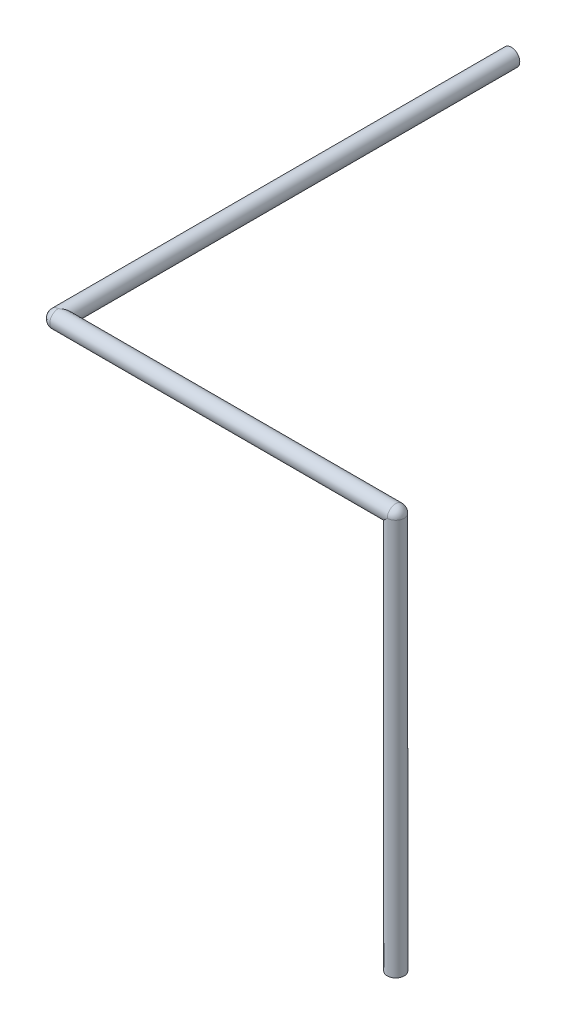
ISO-10303-21;
HEADER;
FILE_DESCRIPTION(('STEP AP214'),'2;1');
FILE_NAME('part.step','',(''),(''),'','','');
FILE_SCHEMA(('AUTOMOTIVE_DESIGN { 1 0 10303 214 1 1 1 1 }'));
ENDSEC;
DATA;
#1=APPLICATION_CONTEXT('core data for automotive mechanical design processes');
#2=APPLICATION_PROTOCOL_DEFINITION('international standard','automotive_design',2000,#1);
#3=PRODUCT_CONTEXT('',#1,'mechanical');
#4=PRODUCT('Part','Part','',(#3));
#5=PRODUCT_RELATED_PRODUCT_CATEGORY('part','',(#4));
#6=PRODUCT_DEFINITION_FORMATION('','',#4);
#7=PRODUCT_DEFINITION_CONTEXT('part definition',#1,'design');
#8=PRODUCT_DEFINITION('design','',#6,#7);
#9=PRODUCT_DEFINITION_SHAPE('','',#8);
#10=(LENGTH_UNIT() NAMED_UNIT(*) SI_UNIT(.MILLI.,.METRE.));
#11=(NAMED_UNIT(*) PLANE_ANGLE_UNIT() SI_UNIT($,.RADIAN.));
#12=(NAMED_UNIT(*) SI_UNIT($,.STERADIAN.) SOLID_ANGLE_UNIT());
#13=UNCERTAINTY_MEASURE_WITH_UNIT(LENGTH_MEASURE(1.E-05),#10,'distance_accuracy_value','');
#14=(GEOMETRIC_REPRESENTATION_CONTEXT(3) GLOBAL_UNCERTAINTY_ASSIGNED_CONTEXT((#13)) GLOBAL_UNIT_ASSIGNED_CONTEXT((#10,
#11,#12)) REPRESENTATION_CONTEXT('',''));
#15=CARTESIAN_POINT('',(0.,0.,0.));
#16=DIRECTION('',(0.,0.,1.));
#17=DIRECTION('',(1.,0.,0.));
#18=AXIS2_PLACEMENT_3D('',#15,#16,#17);
#19=CARTESIAN_POINT('',(0.,0.,101.6));
#20=DIRECTION('',(0.,0.,-1.));
#21=DIRECTION('',(-1.,0.,0.));
#22=AXIS2_PLACEMENT_3D('',#19,#20,#21);
#23=CYLINDRICAL_SURFACE('',#22,1.905);
#24=CARTESIAN_POINT('',(0.,0.,0.));
#25=DIRECTION('',(0.,0.,1.));
#26=DIRECTION('',(1.,0.,0.));
#27=AXIS2_PLACEMENT_3D('',#24,#25,#26);
#28=CIRCLE('',#27,1.905);
#29=CARTESIAN_POINT('',(1.905,0.,0.));
#30=VERTEX_POINT('',#29);
#31=EDGE_CURVE('E42',#30,#30,#28,.T.);
#32=ORIENTED_EDGE('',*,*,#31,.T.);
#33=EDGE_LOOP('',(#32));
#34=FACE_BOUND('',#33,.T.);
#35=CARTESIAN_POINT('',(0.,0.,101.6));
#36=DIRECTION('',(-0.707106781186547,0.,-0.707106781186547));
#37=DIRECTION('',(0.707106781186547,0.,-0.707106781186547));
#38=AXIS2_PLACEMENT_3D('',#35,#36,#37);
#39=ELLIPSE('',#38,2.69407683632075,1.905);
#40=CARTESIAN_POINT('',(0.,-1.90500000000001,101.6));
#41=VERTEX_POINT('',#40);
#42=CARTESIAN_POINT('',(0.,1.905,101.6));
#43=VERTEX_POINT('',#42);
#44=EDGE_CURVE('E78',#41,#43,#39,.F.);
#45=ORIENTED_EDGE('',*,*,#44,.F.);
#46=CARTESIAN_POINT('',(0.,0.,101.6));
#47=DIRECTION('',(0.,0.,1.));
#48=DIRECTION('',(1.,0.,0.));
#49=AXIS2_PLACEMENT_3D('',#46,#47,#48);
#50=CIRCLE('',#49,1.905);
#51=EDGE_CURVE('E11',#43,#41,#50,.T.);
#52=ORIENTED_EDGE('',*,*,#51,.F.);
#53=EDGE_LOOP('',(#45,#52));
#54=FACE_BOUND('',#53,.T.);
#55=ADVANCED_FACE('F39',(#34,#54),#23,.T.);
#56=CARTESIAN_POINT('',(0.,0.,0.));
#57=DIRECTION('',(0.,0.,1.));
#58=DIRECTION('',(1.,0.,0.));
#59=AXIS2_PLACEMENT_3D('',#56,#57,#58);
#60=PLANE('',#59);
#61=ORIENTED_EDGE('',*,*,#31,.F.);
#62=EDGE_LOOP('',(#61));
#63=FACE_BOUND('',#62,.T.);
#64=ADVANCED_FACE('F97',(#63),#60,.F.);
#65=CARTESIAN_POINT('',(75.692,0.,101.6));
#66=DIRECTION('',(-1.,0.,0.));
#67=DIRECTION('',(0.,0.,1.));
#68=AXIS2_PLACEMENT_3D('',#65,#66,#67);
#69=CYLINDRICAL_SURFACE('',#68,1.90500000000001);
#70=CARTESIAN_POINT('',(75.692,0.,101.6));
#71=DIRECTION('',(1.,0.,0.));
#72=DIRECTION('',(0.,0.,-1.));
#73=AXIS2_PLACEMENT_3D('',#70,#71,#72);
#74=CIRCLE('',#73,1.90500000000001);
#75=CARTESIAN_POINT('',(75.692,0.,99.695));
#76=VERTEX_POINT('',#75);
#77=CARTESIAN_POINT('',(75.692,0.,103.505));
#78=VERTEX_POINT('',#77);
#79=EDGE_CURVE('E73',#76,#78,#74,.T.);
#80=ORIENTED_EDGE('',*,*,#79,.F.);
#81=CARTESIAN_POINT('',(75.692,0.,101.6));
#82=DIRECTION('',(-0.707106781186547,0.707106781186547,0.));
#83=DIRECTION('',(-0.707106781186547,-0.707106781186547,0.));
#84=AXIS2_PLACEMENT_3D('',#81,#82,#83);
#85=ELLIPSE('',#84,2.69407683632076,1.90500000000001);
#86=EDGE_CURVE('E63',#76,#78,#85,.T.);
#87=ORIENTED_EDGE('',*,*,#86,.T.);
#88=EDGE_LOOP('',(#80,#87));
#89=FACE_BOUND('',#88,.T.);
#90=CARTESIAN_POINT('',(0.,0.,101.6));
#91=DIRECTION('',(1.,0.,0.));
#92=DIRECTION('',(0.,0.,-1.));
#93=AXIS2_PLACEMENT_3D('',#90,#91,#92);
#94=CIRCLE('',#93,1.90500000000001);
#95=EDGE_CURVE('E54',#43,#41,#94,.T.);
#96=ORIENTED_EDGE('',*,*,#95,.T.);
#97=ORIENTED_EDGE('',*,*,#44,.T.);
#98=EDGE_LOOP('',(#96,#97));
#99=FACE_BOUND('',#98,.T.);
#100=ADVANCED_FACE('F74',(#89,#99),#69,.T.);
#101=CARTESIAN_POINT('',(0.,0.,101.6));
#102=DIRECTION('',(0.,1.,0.));
#103=DIRECTION('',(0.,0.,1.));
#104=AXIS2_PLACEMENT_3D('',#101,#102,#103);
#105=SPHERICAL_SURFACE('',#104,1.905);
#106=ORIENTED_EDGE('',*,*,#51,.T.);
#107=ORIENTED_EDGE('',*,*,#95,.F.);
#108=EDGE_LOOP('',(#106,#107));
#109=FACE_BOUND('',#108,.T.);
#110=ADVANCED_FACE('F103',(#109),#105,.T.);
#111=CARTESIAN_POINT('',(75.692,-88.9,101.6));
#112=DIRECTION('',(0.,1.,0.));
#113=DIRECTION('',(0.,0.,1.));
#114=AXIS2_PLACEMENT_3D('',#111,#112,#113);
#115=CYLINDRICAL_SURFACE('',#114,1.90500000000001);
#116=CARTESIAN_POINT('',(75.692,-88.9,101.6));
#117=DIRECTION('',(0.,1.,0.));
#118=DIRECTION('',(0.,0.,1.));
#119=AXIS2_PLACEMENT_3D('',#116,#117,#118);
#120=CIRCLE('',#119,1.90500000000001);
#121=CARTESIAN_POINT('',(75.692,-88.9,103.505));
#122=VERTEX_POINT('',#121);
#123=EDGE_CURVE('E71',#122,#122,#120,.T.);
#124=ORIENTED_EDGE('',*,*,#123,.T.);
#125=EDGE_LOOP('',(#124));
#126=FACE_BOUND('',#125,.T.);
#127=ORIENTED_EDGE('',*,*,#86,.F.);
#128=CARTESIAN_POINT('',(75.692,0.,101.6));
#129=DIRECTION('',(0.,1.,0.));
#130=DIRECTION('',(0.,0.,1.));
#131=AXIS2_PLACEMENT_3D('',#128,#129,#130);
#132=CIRCLE('',#131,1.90500000000001);
#133=EDGE_CURVE('E67',#78,#76,#132,.T.);
#134=ORIENTED_EDGE('',*,*,#133,.F.);
#135=EDGE_LOOP('',(#127,#134));
#136=FACE_BOUND('',#135,.T.);
#137=ADVANCED_FACE('F65',(#126,#136),#115,.T.);
#138=CARTESIAN_POINT('',(75.692,-88.9,101.6));
#139=DIRECTION('',(0.,1.,0.));
#140=DIRECTION('',(0.,0.,1.));
#141=AXIS2_PLACEMENT_3D('',#138,#139,#140);
#142=PLANE('',#141);
#143=ORIENTED_EDGE('',*,*,#123,.F.);
#144=EDGE_LOOP('',(#143));
#145=FACE_BOUND('',#144,.T.);
#146=ADVANCED_FACE('F110',(#145),#142,.F.);
#147=CARTESIAN_POINT('',(75.692,0.,101.6));
#148=DIRECTION('',(0.,0.,-1.));
#149=DIRECTION('',(1.,0.,0.));
#150=AXIS2_PLACEMENT_3D('',#147,#148,#149);
#151=SPHERICAL_SURFACE('',#150,1.905);
#152=ORIENTED_EDGE('',*,*,#79,.T.);
#153=ORIENTED_EDGE('',*,*,#133,.T.);
#154=EDGE_LOOP('',(#152,#153));
#155=FACE_BOUND('',#154,.T.);
#156=ADVANCED_FACE('F80',(#155),#151,.T.);
#157=CLOSED_SHELL('',(#55,#64,#100,#110,#137,#146,#156));
#158=MANIFOLD_SOLID_BREP('B2',#157);
#159=ADVANCED_BREP_SHAPE_REPRESENTATION('',(#18,#158),#14);
#160=SHAPE_DEFINITION_REPRESENTATION(#9,#159);
ENDSEC;
END-ISO-10303-21;
